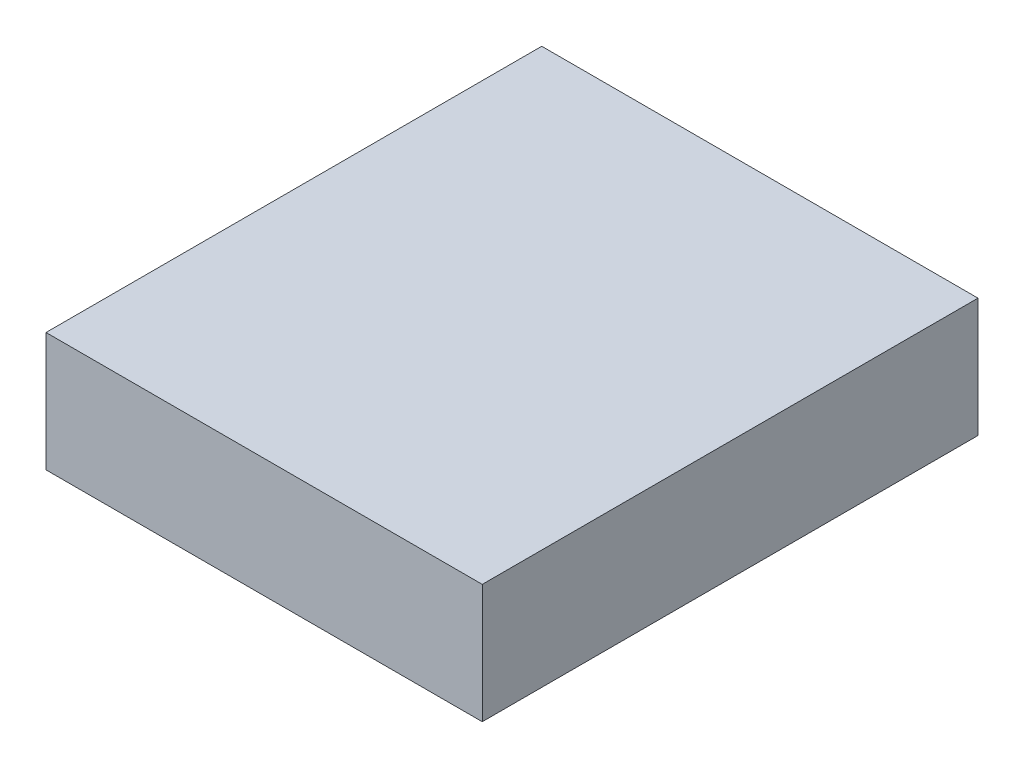
ISO-10303-21;
HEADER;
FILE_DESCRIPTION(('STEP AP214'),'2;1');
FILE_NAME('part.step','',(''),(''),'','','');
FILE_SCHEMA(('AUTOMOTIVE_DESIGN { 1 0 10303 214 1 1 1 1 }'));
ENDSEC;
DATA;
#1=APPLICATION_CONTEXT('core data for automotive mechanical design processes');
#2=APPLICATION_PROTOCOL_DEFINITION('international standard','automotive_design',2000,#1);
#3=PRODUCT_CONTEXT('',#1,'mechanical');
#4=PRODUCT('Part','Part','',(#3));
#5=PRODUCT_RELATED_PRODUCT_CATEGORY('part','',(#4));
#6=PRODUCT_DEFINITION_FORMATION('','',#4);
#7=PRODUCT_DEFINITION_CONTEXT('part definition',#1,'design');
#8=PRODUCT_DEFINITION('design','',#6,#7);
#9=PRODUCT_DEFINITION_SHAPE('','',#8);
#10=(LENGTH_UNIT() NAMED_UNIT(*) SI_UNIT(.MILLI.,.METRE.));
#11=(NAMED_UNIT(*) PLANE_ANGLE_UNIT() SI_UNIT($,.RADIAN.));
#12=(NAMED_UNIT(*) SI_UNIT($,.STERADIAN.) SOLID_ANGLE_UNIT());
#13=UNCERTAINTY_MEASURE_WITH_UNIT(LENGTH_MEASURE(1.E-05),#10,'distance_accuracy_value','');
#14=(GEOMETRIC_REPRESENTATION_CONTEXT(3) GLOBAL_UNCERTAINTY_ASSIGNED_CONTEXT((#13)) GLOBAL_UNIT_ASSIGNED_CONTEXT((#10,
#11,#12)) REPRESENTATION_CONTEXT('',''));
#15=CARTESIAN_POINT('',(0.,0.,0.));
#16=DIRECTION('',(0.,0.,1.));
#17=DIRECTION('',(1.,0.,0.));
#18=AXIS2_PLACEMENT_3D('',#15,#16,#17);
#19=CARTESIAN_POINT('',(35.525,-2.05,-41.65));
#20=DIRECTION('',(0.,-1.,0.));
#21=DIRECTION('',(0.,0.,1.));
#22=AXIS2_PLACEMENT_3D('',#19,#20,#21);
#23=PLANE('',#22);
#24=DIRECTION('',(1.,0.,0.));
#25=VECTOR('',#24,1.);
#26=CARTESIAN_POINT('',(33.325,-2.05,-36.65));
#27=LINE('',#26,#25);
#28=CARTESIAN_POINT('',(31.125,-2.05,-36.65));
#29=VERTEX_POINT('',#28);
#30=CARTESIAN_POINT('',(35.525,-2.05,-36.65));
#31=VERTEX_POINT('',#30);
#32=EDGE_CURVE('E54',#29,#31,#27,.T.);
#33=ORIENTED_EDGE('',*,*,#32,.F.);
#34=DIRECTION('',(0.,0.,1.));
#35=VECTOR('',#34,1.);
#36=CARTESIAN_POINT('',(31.125,-2.05,-39.15));
#37=LINE('',#36,#35);
#38=CARTESIAN_POINT('',(31.125,-2.05,-41.65));
#39=VERTEX_POINT('',#38);
#40=EDGE_CURVE('E69',#39,#29,#37,.T.);
#41=ORIENTED_EDGE('',*,*,#40,.F.);
#42=DIRECTION('',(-1.,0.,0.));
#43=VECTOR('',#42,1.);
#44=CARTESIAN_POINT('',(33.325,-2.05,-41.65));
#45=LINE('',#44,#43);
#46=CARTESIAN_POINT('',(35.525,-2.05,-41.65));
#47=VERTEX_POINT('',#46);
#48=EDGE_CURVE('E21',#47,#39,#45,.T.);
#49=ORIENTED_EDGE('',*,*,#48,.F.);
#50=DIRECTION('',(0.,0.,-1.));
#51=VECTOR('',#50,1.);
#52=CARTESIAN_POINT('',(35.525,-2.05,-39.15));
#53=LINE('',#52,#51);
#54=EDGE_CURVE('E59',#31,#47,#53,.T.);
#55=ORIENTED_EDGE('',*,*,#54,.F.);
#56=EDGE_LOOP('',(#33,#41,#49,#55));
#57=FACE_BOUND('',#56,.T.);
#58=ADVANCED_FACE('F17',(#57),#23,.T.);
#59=CARTESIAN_POINT('',(31.125,-0.85,-41.65));
#60=DIRECTION('',(0.,0.,-1.));
#61=DIRECTION('',(1.,0.,0.));
#62=AXIS2_PLACEMENT_3D('',#59,#60,#61);
#63=PLANE('',#62);
#64=ORIENTED_EDGE('',*,*,#48,.T.);
#65=DIRECTION('',(0.,-1.,0.));
#66=VECTOR('',#65,1.);
#67=CARTESIAN_POINT('',(31.125,-1.45,-41.65));
#68=LINE('',#67,#66);
#69=CARTESIAN_POINT('',(31.125,-0.85,-41.65));
#70=VERTEX_POINT('',#69);
#71=EDGE_CURVE('E80',#70,#39,#68,.T.);
#72=ORIENTED_EDGE('',*,*,#71,.F.);
#73=DIRECTION('',(1.,0.,0.));
#74=VECTOR('',#73,1.);
#75=CARTESIAN_POINT('',(33.325,-0.85,-41.65));
#76=LINE('',#75,#74);
#77=CARTESIAN_POINT('',(35.525,-0.85,-41.65));
#78=VERTEX_POINT('',#77);
#79=EDGE_CURVE('E75',#70,#78,#76,.T.);
#80=ORIENTED_EDGE('',*,*,#79,.T.);
#81=DIRECTION('',(0.,1.,0.));
#82=VECTOR('',#81,1.);
#83=CARTESIAN_POINT('',(35.525,-1.45,-41.65));
#84=LINE('',#83,#82);
#85=EDGE_CURVE('E64',#47,#78,#84,.T.);
#86=ORIENTED_EDGE('',*,*,#85,.F.);
#87=EDGE_LOOP('',(#64,#72,#80,#86));
#88=FACE_BOUND('',#87,.T.);
#89=ADVANCED_FACE('F74',(#88),#63,.T.);
#90=CARTESIAN_POINT('',(35.525,-0.85,-41.65));
#91=DIRECTION('',(1.,0.,0.));
#92=DIRECTION('',(0.,0.,1.));
#93=AXIS2_PLACEMENT_3D('',#90,#91,#92);
#94=PLANE('',#93);
#95=ORIENTED_EDGE('',*,*,#54,.T.);
#96=ORIENTED_EDGE('',*,*,#85,.T.);
#97=DIRECTION('',(0.,0.,1.));
#98=VECTOR('',#97,1.);
#99=CARTESIAN_POINT('',(35.525,-0.85,-39.15));
#100=LINE('',#99,#98);
#101=CARTESIAN_POINT('',(35.525,-0.85,-36.65));
#102=VERTEX_POINT('',#101);
#103=EDGE_CURVE('E85',#78,#102,#100,.T.);
#104=ORIENTED_EDGE('',*,*,#103,.T.);
#105=DIRECTION('',(0.,1.,0.));
#106=VECTOR('',#105,1.);
#107=CARTESIAN_POINT('',(35.525,-1.45,-36.65));
#108=LINE('',#107,#106);
#109=EDGE_CURVE('E66',#31,#102,#108,.T.);
#110=ORIENTED_EDGE('',*,*,#109,.F.);
#111=EDGE_LOOP('',(#95,#96,#104,#110));
#112=FACE_BOUND('',#111,.T.);
#113=ADVANCED_FACE('F61',(#112),#94,.T.);
#114=CARTESIAN_POINT('',(35.525,-0.85,-36.65));
#115=DIRECTION('',(0.,0.,1.));
#116=DIRECTION('',(-1.,0.,0.));
#117=AXIS2_PLACEMENT_3D('',#114,#115,#116);
#118=PLANE('',#117);
#119=ORIENTED_EDGE('',*,*,#32,.T.);
#120=ORIENTED_EDGE('',*,*,#109,.T.);
#121=DIRECTION('',(-1.,0.,0.));
#122=VECTOR('',#121,1.);
#123=CARTESIAN_POINT('',(33.325,-0.85,-36.65));
#124=LINE('',#123,#122);
#125=CARTESIAN_POINT('',(31.125,-0.85,-36.65));
#126=VERTEX_POINT('',#125);
#127=EDGE_CURVE('E27',#102,#126,#124,.T.);
#128=ORIENTED_EDGE('',*,*,#127,.T.);
#129=DIRECTION('',(0.,1.,0.));
#130=VECTOR('',#129,1.);
#131=CARTESIAN_POINT('',(31.125,-1.45,-36.65));
#132=LINE('',#131,#130);
#133=EDGE_CURVE('E35',#29,#126,#132,.T.);
#134=ORIENTED_EDGE('',*,*,#133,.F.);
#135=EDGE_LOOP('',(#119,#120,#128,#134));
#136=FACE_BOUND('',#135,.T.);
#137=ADVANCED_FACE('F89',(#136),#118,.T.);
#138=CARTESIAN_POINT('',(31.125,-0.85,-36.65));
#139=DIRECTION('',(-1.,0.,0.));
#140=DIRECTION('',(0.,0.,-1.));
#141=AXIS2_PLACEMENT_3D('',#138,#139,#140);
#142=PLANE('',#141);
#143=ORIENTED_EDGE('',*,*,#40,.T.);
#144=ORIENTED_EDGE('',*,*,#133,.T.);
#145=DIRECTION('',(0.,0.,-1.));
#146=VECTOR('',#145,1.);
#147=CARTESIAN_POINT('',(31.125,-0.85,-39.15));
#148=LINE('',#147,#146);
#149=EDGE_CURVE('E11',#126,#70,#148,.T.);
#150=ORIENTED_EDGE('',*,*,#149,.T.);
#151=ORIENTED_EDGE('',*,*,#71,.T.);
#152=EDGE_LOOP('',(#143,#144,#150,#151));
#153=FACE_BOUND('',#152,.T.);
#154=ADVANCED_FACE('F91',(#153),#142,.T.);
#155=CARTESIAN_POINT('',(35.525,-0.85,-41.65));
#156=DIRECTION('',(0.,-1.,0.));
#157=DIRECTION('',(0.,0.,1.));
#158=AXIS2_PLACEMENT_3D('',#155,#156,#157);
#159=PLANE('',#158);
#160=ORIENTED_EDGE('',*,*,#127,.F.);
#161=ORIENTED_EDGE('',*,*,#103,.F.);
#162=ORIENTED_EDGE('',*,*,#79,.F.);
#163=ORIENTED_EDGE('',*,*,#149,.F.);
#164=EDGE_LOOP('',(#160,#161,#162,#163));
#165=FACE_BOUND('',#164,.T.);
#166=ADVANCED_FACE('F19',(#165),#159,.F.);
#167=CLOSED_SHELL('',(#58,#89,#113,#137,#154,#166));
#168=MANIFOLD_SOLID_BREP('B1',#167);
#169=ADVANCED_BREP_SHAPE_REPRESENTATION('',(#18,#168),#14);
#170=SHAPE_DEFINITION_REPRESENTATION(#9,#169);
ENDSEC;
END-ISO-10303-21;
